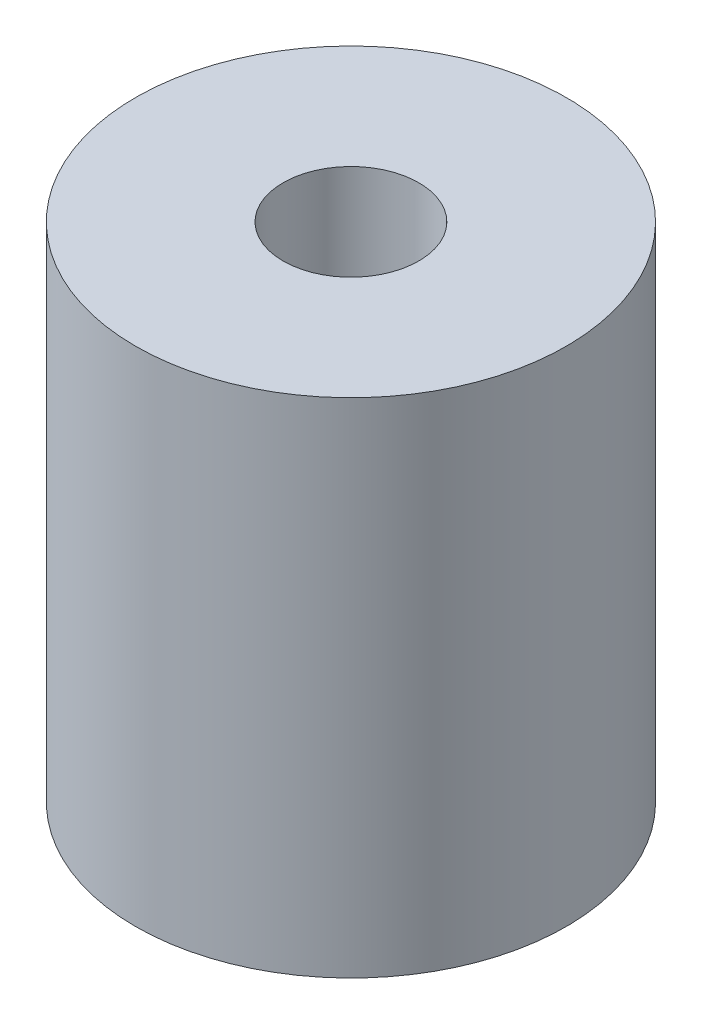
ISO-10303-21;
HEADER;
FILE_DESCRIPTION(('STEP AP214'),'2;1');
FILE_NAME('part.step','',(''),(''),'','','');
FILE_SCHEMA(('AUTOMOTIVE_DESIGN { 1 0 10303 214 1 1 1 1 }'));
ENDSEC;
DATA;
#1=APPLICATION_CONTEXT('core data for automotive mechanical design processes');
#2=APPLICATION_PROTOCOL_DEFINITION('international standard','automotive_design',2000,#1);
#3=PRODUCT_CONTEXT('',#1,'mechanical');
#4=PRODUCT('Part','Part','',(#3));
#5=PRODUCT_RELATED_PRODUCT_CATEGORY('part','',(#4));
#6=PRODUCT_DEFINITION_FORMATION('','',#4);
#7=PRODUCT_DEFINITION_CONTEXT('part definition',#1,'design');
#8=PRODUCT_DEFINITION('design','',#6,#7);
#9=PRODUCT_DEFINITION_SHAPE('','',#8);
#10=(LENGTH_UNIT() NAMED_UNIT(*) SI_UNIT(.MILLI.,.METRE.));
#11=(NAMED_UNIT(*) PLANE_ANGLE_UNIT() SI_UNIT($,.RADIAN.));
#12=(NAMED_UNIT(*) SI_UNIT($,.STERADIAN.) SOLID_ANGLE_UNIT());
#13=UNCERTAINTY_MEASURE_WITH_UNIT(LENGTH_MEASURE(1.E-05),#10,'distance_accuracy_value','');
#14=(GEOMETRIC_REPRESENTATION_CONTEXT(3) GLOBAL_UNCERTAINTY_ASSIGNED_CONTEXT((#13)) GLOBAL_UNIT_ASSIGNED_CONTEXT((#10,
#11,#12)) REPRESENTATION_CONTEXT('',''));
#15=CARTESIAN_POINT('',(0.,0.,0.));
#16=DIRECTION('',(0.,0.,1.));
#17=DIRECTION('',(1.,0.,0.));
#18=AXIS2_PLACEMENT_3D('',#15,#16,#17);
#19=CARTESIAN_POINT('',(0.,-11.1125,0.));
#20=DIRECTION('',(0.,1.,0.));
#21=DIRECTION('',(0.,0.,1.));
#22=AXIS2_PLACEMENT_3D('',#19,#20,#21);
#23=CYLINDRICAL_SURFACE('',#22,4.7625);
#24=CARTESIAN_POINT('',(0.,-11.1125,0.));
#25=DIRECTION('',(0.,1.,0.));
#26=DIRECTION('',(0.,0.,1.));
#27=AXIS2_PLACEMENT_3D('',#24,#25,#26);
#28=CIRCLE('',#27,4.7625);
#29=CARTESIAN_POINT('',(0.,-11.1125,4.7625));
#30=VERTEX_POINT('',#29);
#31=EDGE_CURVE('E10',#30,#30,#28,.T.);
#32=ORIENTED_EDGE('',*,*,#31,.T.);
#33=EDGE_LOOP('',(#32));
#34=FACE_BOUND('',#33,.T.);
#35=CARTESIAN_POINT('',(0.,0.,0.));
#36=DIRECTION('',(0.,1.,0.));
#37=DIRECTION('',(0.,0.,1.));
#38=AXIS2_PLACEMENT_3D('',#35,#36,#37);
#39=CIRCLE('',#38,4.7625);
#40=CARTESIAN_POINT('',(0.,0.,4.7625));
#41=VERTEX_POINT('',#40);
#42=EDGE_CURVE('E364',#41,#41,#39,.T.);
#43=ORIENTED_EDGE('',*,*,#42,.F.);
#44=EDGE_LOOP('',(#43));
#45=FACE_BOUND('',#44,.T.);
#46=ADVANCED_FACE('F358',(#34,#45),#23,.T.);
#47=CARTESIAN_POINT('',(0.,-11.1125,0.));
#48=DIRECTION('',(0.,1.,0.));
#49=DIRECTION('',(0.,0.,1.));
#50=AXIS2_PLACEMENT_3D('',#47,#48,#49);
#51=PLANE('',#50);
#52=CARTESIAN_POINT('',(0.,-11.1125,0.));
#53=DIRECTION('',(0.,1.,0.));
#54=DIRECTION('',(0.,0.,1.));
#55=AXIS2_PLACEMENT_3D('',#52,#53,#54);
#56=CIRCLE('',#55,1.5);
#57=CARTESIAN_POINT('',(0.,-11.1125,1.5));
#58=VERTEX_POINT('',#57);
#59=EDGE_CURVE('E368',#58,#58,#56,.T.);
#60=ORIENTED_EDGE('',*,*,#59,.T.);
#61=EDGE_LOOP('',(#60));
#62=FACE_BOUND('',#61,.T.);
#63=ORIENTED_EDGE('',*,*,#31,.F.);
#64=EDGE_LOOP('',(#63));
#65=FACE_BOUND('',#64,.T.);
#66=ADVANCED_FACE('F382',(#62,#65),#51,.F.);
#67=CARTESIAN_POINT('',(0.,0.,0.));
#68=DIRECTION('',(0.,1.,0.));
#69=DIRECTION('',(0.,0.,1.));
#70=AXIS2_PLACEMENT_3D('',#67,#68,#69);
#71=PLANE('',#70);
#72=CARTESIAN_POINT('',(0.,0.,0.));
#73=DIRECTION('',(0.,1.,0.));
#74=DIRECTION('',(0.,0.,1.));
#75=AXIS2_PLACEMENT_3D('',#72,#73,#74);
#76=CIRCLE('',#75,1.5);
#77=CARTESIAN_POINT('',(0.,0.,1.5));
#78=VERTEX_POINT('',#77);
#79=EDGE_CURVE('E372',#78,#78,#76,.T.);
#80=ORIENTED_EDGE('',*,*,#79,.F.);
#81=EDGE_LOOP('',(#80));
#82=FACE_BOUND('',#81,.T.);
#83=ORIENTED_EDGE('',*,*,#42,.T.);
#84=EDGE_LOOP('',(#83));
#85=FACE_BOUND('',#84,.T.);
#86=ADVANCED_FACE('F380',(#82,#85),#71,.T.);
#87=CARTESIAN_POINT('',(0.,-11.1125,0.));
#88=DIRECTION('',(0.,1.,0.));
#89=DIRECTION('',(0.,0.,1.));
#90=AXIS2_PLACEMENT_3D('',#87,#88,#89);
#91=CYLINDRICAL_SURFACE('',#90,1.5);
#92=ORIENTED_EDGE('',*,*,#59,.F.);
#93=EDGE_LOOP('',(#92));
#94=FACE_BOUND('',#93,.T.);
#95=ORIENTED_EDGE('',*,*,#79,.T.);
#96=EDGE_LOOP('',(#95));
#97=FACE_BOUND('',#96,.T.);
#98=ADVANCED_FACE('F378',(#94,#97),#91,.F.);
#99=CLOSED_SHELL('',(#46,#66,#86,#98));
#100=MANIFOLD_SOLID_BREP('B2',#99);
#101=ADVANCED_BREP_SHAPE_REPRESENTATION('',(#18,#100),#14);
#102=SHAPE_DEFINITION_REPRESENTATION(#9,#101);
ENDSEC;
END-ISO-10303-21;
